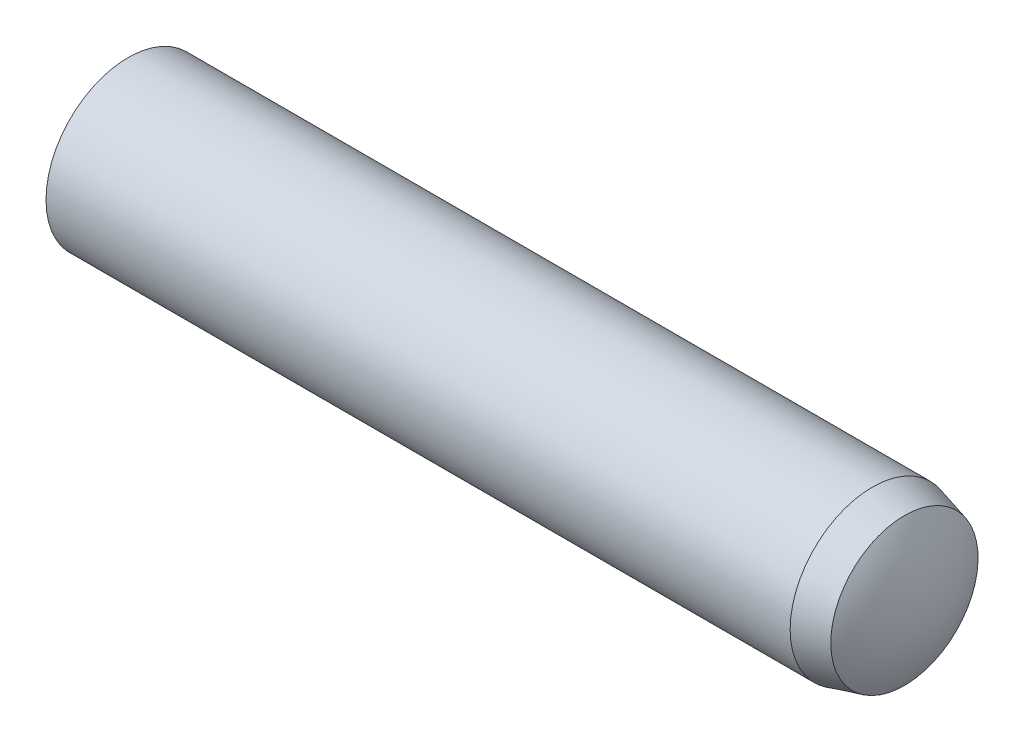
ISO-10303-21;
HEADER;
FILE_DESCRIPTION(('STEP AP214'),'2;1');
FILE_NAME('part.step','',(''),(''),'','','');
FILE_SCHEMA(('AUTOMOTIVE_DESIGN { 1 0 10303 214 1 1 1 1 }'));
ENDSEC;
DATA;
#1=APPLICATION_CONTEXT('core data for automotive mechanical design processes');
#2=APPLICATION_PROTOCOL_DEFINITION('international standard','automotive_design',2000,#1);
#3=PRODUCT_CONTEXT('',#1,'mechanical');
#4=PRODUCT('Part','Part','',(#3));
#5=PRODUCT_RELATED_PRODUCT_CATEGORY('part','',(#4));
#6=PRODUCT_DEFINITION_FORMATION('','',#4);
#7=PRODUCT_DEFINITION_CONTEXT('part definition',#1,'design');
#8=PRODUCT_DEFINITION('design','',#6,#7);
#9=PRODUCT_DEFINITION_SHAPE('','',#8);
#10=(LENGTH_UNIT() NAMED_UNIT(*) SI_UNIT(.MILLI.,.METRE.));
#11=(NAMED_UNIT(*) PLANE_ANGLE_UNIT() SI_UNIT($,.RADIAN.));
#12=(NAMED_UNIT(*) SI_UNIT($,.STERADIAN.) SOLID_ANGLE_UNIT());
#13=UNCERTAINTY_MEASURE_WITH_UNIT(LENGTH_MEASURE(1.E-05),#10,'distance_accuracy_value','');
#14=(GEOMETRIC_REPRESENTATION_CONTEXT(3) GLOBAL_UNCERTAINTY_ASSIGNED_CONTEXT((#13)) GLOBAL_UNIT_ASSIGNED_CONTEXT((#10,
#11,#12)) REPRESENTATION_CONTEXT('',''));
#15=CARTESIAN_POINT('',(0.,0.,0.));
#16=DIRECTION('',(0.,0.,1.));
#17=DIRECTION('',(1.,0.,0.));
#18=AXIS2_PLACEMENT_3D('',#15,#16,#17);
#19=CARTESIAN_POINT('',(-5.,0.,0.));
#20=DIRECTION('',(1.,0.,0.));
#21=DIRECTION('',(0.,0.,-1.));
#22=AXIS2_PLACEMENT_3D('',#19,#20,#21);
#23=CYLINDRICAL_SURFACE('',#22,0.999999999999999);
#24=CARTESIAN_POINT('',(4.35,0.,0.));
#25=DIRECTION('',(-1.,0.,0.));
#26=DIRECTION('',(0.,0.,1.));
#27=AXIS2_PLACEMENT_3D('',#24,#25,#26);
#28=CIRCLE('',#27,0.999999999999992);
#29=CARTESIAN_POINT('',(4.35,0.,0.999999999999992));
#30=VERTEX_POINT('',#29);
#31=EDGE_CURVE('E11',#30,#30,#28,.T.);
#32=ORIENTED_EDGE('',*,*,#31,.T.);
#33=EDGE_LOOP('',(#32));
#34=FACE_BOUND('',#33,.T.);
#35=CARTESIAN_POINT('',(-4.7,0.,0.));
#36=DIRECTION('',(-1.,0.,0.));
#37=DIRECTION('',(0.,0.,1.));
#38=AXIS2_PLACEMENT_3D('',#35,#36,#37);
#39=CIRCLE('',#38,0.999999999999999);
#40=CARTESIAN_POINT('',(-4.7,0.,0.999999999999999));
#41=VERTEX_POINT('',#40);
#42=EDGE_CURVE('E51',#41,#41,#39,.T.);
#43=ORIENTED_EDGE('',*,*,#42,.F.);
#44=EDGE_LOOP('',(#43));
#45=FACE_BOUND('',#44,.T.);
#46=ADVANCED_FACE('F31',(#34,#45),#23,.T.);
#47=CARTESIAN_POINT('',(4.35,0.,0.));
#48=DIRECTION('',(-1.,0.,0.));
#49=DIRECTION('',(0.,0.,1.));
#50=AXIS2_PLACEMENT_3D('',#47,#48,#49);
#51=CONICAL_SURFACE('',#50,0.999999999999992,0.261799387799151);
#52=CARTESIAN_POINT('',(4.74,0.,0.));
#53=DIRECTION('',(-1.,0.,0.));
#54=DIRECTION('',(0.,0.,1.));
#55=AXIS2_PLACEMENT_3D('',#52,#53,#54);
#56=CIRCLE('',#55,0.895499814951853);
#57=CARTESIAN_POINT('',(4.74,0.,0.895499814951853));
#58=VERTEX_POINT('',#57);
#59=EDGE_CURVE('E38',#58,#58,#56,.T.);
#60=ORIENTED_EDGE('',*,*,#59,.T.);
#61=EDGE_LOOP('',(#60));
#62=FACE_BOUND('',#61,.T.);
#63=ORIENTED_EDGE('',*,*,#31,.F.);
#64=EDGE_LOOP('',(#63));
#65=FACE_BOUND('',#64,.T.);
#66=ADVANCED_FACE('F57',(#62,#65),#51,.T.);
#67=CARTESIAN_POINT('',(3.32784631042534,0.,0.));
#68=DIRECTION('',(-1.,0.,0.));
#69=DIRECTION('',(0.,1.,0.));
#70=AXIS2_PLACEMENT_3D('',#67,#68,#69);
#71=SPHERICAL_SURFACE('',#70,1.67215368957466);
#72=CARTESIAN_POINT('',(5.,0.,0.));
#73=VERTEX_POINT('',#72);
#74=VERTEX_LOOP('',#73);
#75=FACE_BOUND('',#74,.T.);
#76=ORIENTED_EDGE('',*,*,#59,.F.);
#77=EDGE_LOOP('',(#76));
#78=FACE_BOUND('',#77,.T.);
#79=ADVANCED_FACE('F47',(#75,#78),#71,.T.);
#80=CARTESIAN_POINT('',(-3.18333333333333,0.,0.));
#81=DIRECTION('',(-1.,0.,0.));
#82=DIRECTION('',(0.,-1.,0.));
#83=AXIS2_PLACEMENT_3D('',#80,#81,#82);
#84=SPHERICAL_SURFACE('',#83,1.81666666666667);
#85=CARTESIAN_POINT('',(-5.,0.,0.));
#86=VERTEX_POINT('',#85);
#87=VERTEX_LOOP('',#86);
#88=FACE_BOUND('',#87,.T.);
#89=ORIENTED_EDGE('',*,*,#42,.T.);
#90=EDGE_LOOP('',(#89));
#91=FACE_BOUND('',#90,.T.);
#92=ADVANCED_FACE('F44',(#88,#91),#84,.T.);
#93=CLOSED_SHELL('',(#46,#66,#79,#92));
#94=MANIFOLD_SOLID_BREP('B2',#93);
#95=ADVANCED_BREP_SHAPE_REPRESENTATION('',(#18,#94),#14);
#96=SHAPE_DEFINITION_REPRESENTATION(#9,#95);
ENDSEC;
END-ISO-10303-21;
